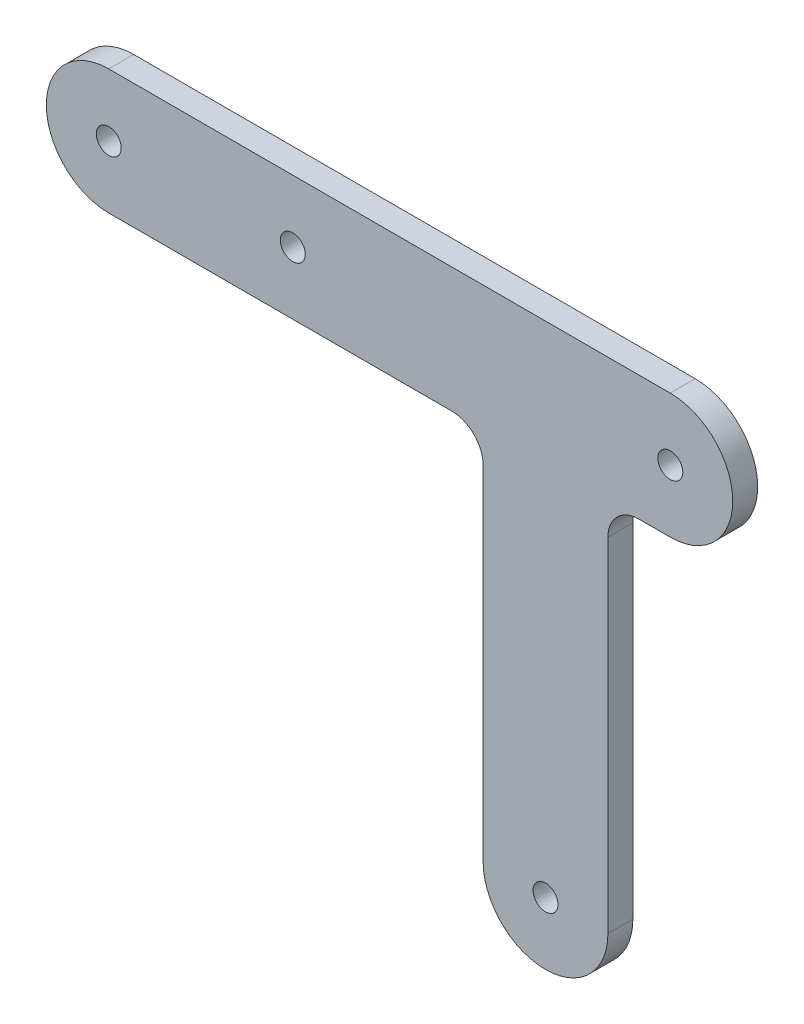
ISO-10303-21;
HEADER;
FILE_DESCRIPTION(('STEP AP214'),'2;1');
FILE_NAME('part.step','',(''),(''),'','','');
FILE_SCHEMA(('AUTOMOTIVE_DESIGN { 1 0 10303 214 1 1 1 1 }'));
ENDSEC;
DATA;
#1=APPLICATION_CONTEXT('core data for automotive mechanical design processes');
#2=APPLICATION_PROTOCOL_DEFINITION('international standard','automotive_design',2000,#1);
#3=PRODUCT_CONTEXT('',#1,'mechanical');
#4=PRODUCT('Part','Part','',(#3));
#5=PRODUCT_RELATED_PRODUCT_CATEGORY('part','',(#4));
#6=PRODUCT_DEFINITION_FORMATION('','',#4);
#7=PRODUCT_DEFINITION_CONTEXT('part definition',#1,'design');
#8=PRODUCT_DEFINITION('design','',#6,#7);
#9=PRODUCT_DEFINITION_SHAPE('','',#8);
#10=(LENGTH_UNIT() NAMED_UNIT(*) SI_UNIT(.MILLI.,.METRE.));
#11=(NAMED_UNIT(*) PLANE_ANGLE_UNIT() SI_UNIT($,.RADIAN.));
#12=(NAMED_UNIT(*) SI_UNIT($,.STERADIAN.) SOLID_ANGLE_UNIT());
#13=UNCERTAINTY_MEASURE_WITH_UNIT(LENGTH_MEASURE(1.E-05),#10,'distance_accuracy_value','');
#14=(GEOMETRIC_REPRESENTATION_CONTEXT(3) GLOBAL_UNCERTAINTY_ASSIGNED_CONTEXT((#13)) GLOBAL_UNIT_ASSIGNED_CONTEXT((#10,
#11,#12)) REPRESENTATION_CONTEXT('',''));
#15=CARTESIAN_POINT('',(0.,0.,0.));
#16=DIRECTION('',(0.,0.,1.));
#17=DIRECTION('',(1.,0.,0.));
#18=AXIS2_PLACEMENT_3D('',#15,#16,#17);
#19=CARTESIAN_POINT('',(0.,-15.6780851241907,4.));
#20=DIRECTION('',(0.,-1.,0.));
#21=DIRECTION('',(0.,0.,-1.));
#22=AXIS2_PLACEMENT_3D('',#19,#20,#21);
#23=PLANE('',#22);
#24=DIRECTION('',(-1.,0.,0.));
#25=VECTOR('',#24,1.);
#26=CARTESIAN_POINT('',(0.,-15.6780851241907,0.));
#27=LINE('',#26,#25);
#28=CARTESIAN_POINT('',(-8.1082175024389,-15.6780851241907,0.));
#29=VERTEX_POINT('',#28);
#30=CARTESIAN_POINT('',(-13.1082175024389,-15.6780851241907,0.));
#31=VERTEX_POINT('',#30);
#32=EDGE_CURVE('E157',#29,#31,#27,.T.);
#33=ORIENTED_EDGE('',*,*,#32,.F.);
#34=DIRECTION('',(0.,0.,-1.));
#35=VECTOR('',#34,1.);
#36=CARTESIAN_POINT('',(-8.1082175024389,-15.6780851241907,4.));
#37=LINE('',#36,#35);
#38=CARTESIAN_POINT('',(-8.1082175024389,-15.6780851241907,4.));
#39=VERTEX_POINT('',#38);
#40=EDGE_CURVE('E11',#39,#29,#37,.T.);
#41=ORIENTED_EDGE('',*,*,#40,.F.);
#42=DIRECTION('',(-1.,0.,0.));
#43=VECTOR('',#42,1.);
#44=CARTESIAN_POINT('',(0.,-15.6780851241907,4.));
#45=LINE('',#44,#43);
#46=CARTESIAN_POINT('',(-13.1082175024389,-15.6780851241907,4.));
#47=VERTEX_POINT('',#46);
#48=EDGE_CURVE('E192',#39,#47,#45,.T.);
#49=ORIENTED_EDGE('',*,*,#48,.T.);
#50=DIRECTION('',(0.,0.,-1.));
#51=VECTOR('',#50,1.);
#52=CARTESIAN_POINT('',(-13.1082175024389,-15.6780851241907,4.));
#53=LINE('',#52,#51);
#54=EDGE_CURVE('E53',#47,#31,#53,.T.);
#55=ORIENTED_EDGE('',*,*,#54,.T.);
#56=EDGE_LOOP('',(#33,#41,#49,#55));
#57=FACE_BOUND('',#56,.T.);
#58=ADVANCED_FACE('F37',(#57),#23,.T.);
#59=CARTESIAN_POINT('',(-8.1082175024389,-5.67808512419069,4.));
#60=DIRECTION('',(0.,0.,-1.));
#61=DIRECTION('',(-1.,0.,0.));
#62=AXIS2_PLACEMENT_3D('',#59,#60,#61);
#63=CYLINDRICAL_SURFACE('',#62,10.);
#64=CARTESIAN_POINT('',(-8.1082175024389,-5.67808512419069,0.));
#65=DIRECTION('',(0.,0.,1.));
#66=DIRECTION('',(1.,0.,0.));
#67=AXIS2_PLACEMENT_3D('',#64,#65,#66);
#68=CIRCLE('',#67,10.);
#69=CARTESIAN_POINT('',(-8.1082175024389,4.32191487580931,0.));
#70=VERTEX_POINT('',#69);
#71=EDGE_CURVE('E159',#29,#70,#68,.T.);
#72=ORIENTED_EDGE('',*,*,#71,.T.);
#73=DIRECTION('',(0.,0.,-1.));
#74=VECTOR('',#73,1.);
#75=CARTESIAN_POINT('',(-8.1082175024389,4.32191487580931,4.));
#76=LINE('',#75,#74);
#77=CARTESIAN_POINT('',(-8.1082175024389,4.32191487580931,4.));
#78=VERTEX_POINT('',#77);
#79=EDGE_CURVE('E45',#78,#70,#76,.T.);
#80=ORIENTED_EDGE('',*,*,#79,.F.);
#81=CARTESIAN_POINT('',(-8.1082175024389,-5.67808512419069,4.));
#82=DIRECTION('',(0.,0.,1.));
#83=DIRECTION('',(1.,0.,0.));
#84=AXIS2_PLACEMENT_3D('',#81,#82,#83);
#85=CIRCLE('',#84,10.);
#86=EDGE_CURVE('E230',#39,#78,#85,.T.);
#87=ORIENTED_EDGE('',*,*,#86,.F.);
#88=ORIENTED_EDGE('',*,*,#40,.T.);
#89=EDGE_LOOP('',(#72,#80,#87,#88));
#90=FACE_BOUND('',#89,.T.);
#91=ADVANCED_FACE('F252',(#90),#63,.T.);
#92=CARTESIAN_POINT('',(0.,4.32191487580931,4.));
#93=DIRECTION('',(0.,-1.,0.));
#94=DIRECTION('',(1.,0.,0.));
#95=AXIS2_PLACEMENT_3D('',#92,#93,#94);
#96=PLANE('',#95);
#97=DIRECTION('',(-1.,0.,0.));
#98=VECTOR('',#97,1.);
#99=CARTESIAN_POINT('',(0.,4.32191487580931,0.));
#100=LINE('',#99,#98);
#101=CARTESIAN_POINT('',(-98.1082175024389,4.3219148758093,0.));
#102=VERTEX_POINT('',#101);
#103=EDGE_CURVE('E161',#70,#102,#100,.T.);
#104=ORIENTED_EDGE('',*,*,#103,.T.);
#105=DIRECTION('',(0.,0.,-1.));
#106=VECTOR('',#105,1.);
#107=CARTESIAN_POINT('',(-98.1082175024389,4.3219148758093,4.));
#108=LINE('',#107,#106);
#109=CARTESIAN_POINT('',(-98.1082175024389,4.3219148758093,4.));
#110=VERTEX_POINT('',#109);
#111=EDGE_CURVE('E202',#110,#102,#108,.T.);
#112=ORIENTED_EDGE('',*,*,#111,.F.);
#113=DIRECTION('',(-1.,0.,0.));
#114=VECTOR('',#113,1.);
#115=CARTESIAN_POINT('',(0.,4.32191487580931,4.));
#116=LINE('',#115,#114);
#117=EDGE_CURVE('E211',#78,#110,#116,.T.);
#118=ORIENTED_EDGE('',*,*,#117,.F.);
#119=ORIENTED_EDGE('',*,*,#79,.T.);
#120=EDGE_LOOP('',(#104,#112,#118,#119));
#121=FACE_BOUND('',#120,.T.);
#122=ADVANCED_FACE('F209',(#121),#96,.F.);
#123=CARTESIAN_POINT('',(-98.1082175024389,-5.67808512418913,4.));
#124=DIRECTION('',(0.,0.,-1.));
#125=DIRECTION('',(-1.,0.,0.));
#126=AXIS2_PLACEMENT_3D('',#123,#124,#125);
#127=CYLINDRICAL_SURFACE('',#126,10.);
#128=CARTESIAN_POINT('',(-98.1082175024389,-5.67808512418913,0.));
#129=DIRECTION('',(0.,0.,1.));
#130=DIRECTION('',(1.,0.,0.));
#131=AXIS2_PLACEMENT_3D('',#128,#129,#130);
#132=CIRCLE('',#131,10.);
#133=CARTESIAN_POINT('',(-98.1082175024389,-15.6780851241907,0.));
#134=VERTEX_POINT('',#133);
#135=EDGE_CURVE('E163',#102,#134,#132,.T.);
#136=ORIENTED_EDGE('',*,*,#135,.T.);
#137=DIRECTION('',(0.,0.,-1.));
#138=VECTOR('',#137,1.);
#139=CARTESIAN_POINT('',(-98.1082175024389,-15.6780851241907,4.));
#140=LINE('',#139,#138);
#141=CARTESIAN_POINT('',(-98.1082175024389,-15.6780851241907,4.));
#142=VERTEX_POINT('',#141);
#143=EDGE_CURVE('E200',#142,#134,#140,.T.);
#144=ORIENTED_EDGE('',*,*,#143,.F.);
#145=CARTESIAN_POINT('',(-98.1082175024389,-5.67808512418913,4.));
#146=DIRECTION('',(0.,0.,1.));
#147=DIRECTION('',(1.,0.,0.));
#148=AXIS2_PLACEMENT_3D('',#145,#146,#147);
#149=CIRCLE('',#148,10.);
#150=EDGE_CURVE('E224',#110,#142,#149,.T.);
#151=ORIENTED_EDGE('',*,*,#150,.F.);
#152=ORIENTED_EDGE('',*,*,#111,.T.);
#153=EDGE_LOOP('',(#136,#144,#151,#152));
#154=FACE_BOUND('',#153,.T.);
#155=ADVANCED_FACE('F221',(#154),#127,.T.);
#156=CARTESIAN_POINT('',(0.,-15.6780851241907,4.));
#157=DIRECTION('',(0.,-1.,0.));
#158=DIRECTION('',(1.,0.,0.));
#159=AXIS2_PLACEMENT_3D('',#156,#157,#158);
#160=PLANE('',#159);
#161=DIRECTION('',(-1.,0.,0.));
#162=VECTOR('',#161,1.);
#163=CARTESIAN_POINT('',(0.,-15.6780851241907,0.));
#164=LINE('',#163,#162);
#165=CARTESIAN_POINT('',(-43.1082175024389,-15.6780851241907,0.));
#166=VERTEX_POINT('',#165);
#167=EDGE_CURVE('E166',#166,#134,#164,.T.);
#168=ORIENTED_EDGE('',*,*,#167,.F.);
#169=DIRECTION('',(0.,0.,-1.));
#170=VECTOR('',#169,1.);
#171=CARTESIAN_POINT('',(-43.1082175024389,-15.6780851241907,4.));
#172=LINE('',#171,#170);
#173=CARTESIAN_POINT('',(-43.1082175024389,-15.6780851241907,4.));
#174=VERTEX_POINT('',#173);
#175=EDGE_CURVE('E198',#174,#166,#172,.T.);
#176=ORIENTED_EDGE('',*,*,#175,.F.);
#177=DIRECTION('',(-1.,0.,0.));
#178=VECTOR('',#177,1.);
#179=CARTESIAN_POINT('',(0.,-15.6780851241907,4.));
#180=LINE('',#179,#178);
#181=EDGE_CURVE('E226',#174,#142,#180,.T.);
#182=ORIENTED_EDGE('',*,*,#181,.T.);
#183=ORIENTED_EDGE('',*,*,#143,.T.);
#184=EDGE_LOOP('',(#168,#176,#182,#183));
#185=FACE_BOUND('',#184,.T.);
#186=ADVANCED_FACE('F239',(#185),#160,.T.);
#187=CARTESIAN_POINT('',(-43.1082175024389,-20.6780851241907,4.));
#188=DIRECTION('',(0.,0.,-1.));
#189=DIRECTION('',(-1.,0.,0.));
#190=AXIS2_PLACEMENT_3D('',#187,#188,#189);
#191=CYLINDRICAL_SURFACE('',#190,5.);
#192=CARTESIAN_POINT('',(-43.1082175024389,-20.6780851241907,0.));
#193=DIRECTION('',(0.,0.,1.));
#194=DIRECTION('',(1.,0.,0.));
#195=AXIS2_PLACEMENT_3D('',#192,#193,#194);
#196=CIRCLE('',#195,5.);
#197=CARTESIAN_POINT('',(-38.1082175024389,-20.6780851241907,0.));
#198=VERTEX_POINT('',#197);
#199=EDGE_CURVE('E169',#198,#166,#196,.T.);
#200=ORIENTED_EDGE('',*,*,#199,.F.);
#201=DIRECTION('',(0.,0.,-1.));
#202=VECTOR('',#201,1.);
#203=CARTESIAN_POINT('',(-38.1082175024389,-20.6780851241907,4.));
#204=LINE('',#203,#202);
#205=CARTESIAN_POINT('',(-38.1082175024389,-20.6780851241907,4.));
#206=VERTEX_POINT('',#205);
#207=EDGE_CURVE('E196',#206,#198,#204,.T.);
#208=ORIENTED_EDGE('',*,*,#207,.F.);
#209=CARTESIAN_POINT('',(-43.1082175024389,-20.6780851241907,4.));
#210=DIRECTION('',(0.,0.,1.));
#211=DIRECTION('',(1.,0.,0.));
#212=AXIS2_PLACEMENT_3D('',#209,#210,#211);
#213=CIRCLE('',#212,5.);
#214=EDGE_CURVE('E228',#206,#174,#213,.T.);
#215=ORIENTED_EDGE('',*,*,#214,.T.);
#216=ORIENTED_EDGE('',*,*,#175,.T.);
#217=EDGE_LOOP('',(#200,#208,#215,#216));
#218=FACE_BOUND('',#217,.T.);
#219=ADVANCED_FACE('F237',(#218),#191,.F.);
#220=CARTESIAN_POINT('',(-38.1082175024389,0.,4.));
#221=DIRECTION('',(1.,0.,0.));
#222=DIRECTION('',(0.,1.,0.));
#223=AXIS2_PLACEMENT_3D('',#220,#221,#222);
#224=PLANE('',#223);
#225=DIRECTION('',(0.,-1.,0.));
#226=VECTOR('',#225,1.);
#227=CARTESIAN_POINT('',(-38.1082175024389,0.,0.));
#228=LINE('',#227,#226);
#229=CARTESIAN_POINT('',(-38.1082175024389,-75.6780851241907,0.));
#230=VERTEX_POINT('',#229);
#231=EDGE_CURVE('E172',#198,#230,#228,.T.);
#232=ORIENTED_EDGE('',*,*,#231,.T.);
#233=DIRECTION('',(0.,0.,-1.));
#234=VECTOR('',#233,1.);
#235=CARTESIAN_POINT('',(-38.1082175024389,-75.6780851241907,4.));
#236=LINE('',#235,#234);
#237=CARTESIAN_POINT('',(-38.1082175024389,-75.6780851241907,4.));
#238=VERTEX_POINT('',#237);
#239=EDGE_CURVE('E137',#238,#230,#236,.T.);
#240=ORIENTED_EDGE('',*,*,#239,.F.);
#241=DIRECTION('',(0.,-1.,0.));
#242=VECTOR('',#241,1.);
#243=CARTESIAN_POINT('',(-38.1082175024389,0.,4.));
#244=LINE('',#243,#242);
#245=EDGE_CURVE('E125',#206,#238,#244,.T.);
#246=ORIENTED_EDGE('',*,*,#245,.F.);
#247=ORIENTED_EDGE('',*,*,#207,.T.);
#248=EDGE_LOOP('',(#232,#240,#246,#247));
#249=FACE_BOUND('',#248,.T.);
#250=ADVANCED_FACE('F242',(#249),#224,.F.);
#251=CARTESIAN_POINT('',(-28.1082175024389,-75.6780851241907,4.));
#252=DIRECTION('',(0.,0.,-1.));
#253=DIRECTION('',(-1.,0.,0.));
#254=AXIS2_PLACEMENT_3D('',#251,#252,#253);
#255=CYLINDRICAL_SURFACE('',#254,10.);
#256=CARTESIAN_POINT('',(-28.1082175024389,-75.6780851241907,0.));
#257=DIRECTION('',(0.,0.,1.));
#258=DIRECTION('',(1.,0.,0.));
#259=AXIS2_PLACEMENT_3D('',#256,#257,#258);
#260=CIRCLE('',#259,10.);
#261=CARTESIAN_POINT('',(-18.1082175024389,-75.6780851241907,0.));
#262=VERTEX_POINT('',#261);
#263=EDGE_CURVE('E134',#230,#262,#260,.T.);
#264=ORIENTED_EDGE('',*,*,#263,.T.);
#265=DIRECTION('',(0.,0.,-1.));
#266=VECTOR('',#265,1.);
#267=CARTESIAN_POINT('',(-18.1082175024389,-75.6780851241907,4.));
#268=LINE('',#267,#266);
#269=CARTESIAN_POINT('',(-18.1082175024389,-75.6780851241907,4.));
#270=VERTEX_POINT('',#269);
#271=EDGE_CURVE('E131',#270,#262,#268,.T.);
#272=ORIENTED_EDGE('',*,*,#271,.F.);
#273=CARTESIAN_POINT('',(-28.1082175024389,-75.6780851241907,4.));
#274=DIRECTION('',(0.,0.,1.));
#275=DIRECTION('',(1.,0.,0.));
#276=AXIS2_PLACEMENT_3D('',#273,#274,#275);
#277=CIRCLE('',#276,10.);
#278=EDGE_CURVE('E115',#238,#270,#277,.T.);
#279=ORIENTED_EDGE('',*,*,#278,.F.);
#280=ORIENTED_EDGE('',*,*,#239,.T.);
#281=EDGE_LOOP('',(#264,#272,#279,#280));
#282=FACE_BOUND('',#281,.T.);
#283=ADVANCED_FACE('F132',(#282),#255,.T.);
#284=CARTESIAN_POINT('',(-18.1082175024389,0.,4.));
#285=DIRECTION('',(1.,0.,0.));
#286=DIRECTION('',(0.,1.,0.));
#287=AXIS2_PLACEMENT_3D('',#284,#285,#286);
#288=PLANE('',#287);
#289=DIRECTION('',(0.,-1.,0.));
#290=VECTOR('',#289,1.);
#291=CARTESIAN_POINT('',(-18.1082175024389,0.,0.));
#292=LINE('',#291,#290);
#293=CARTESIAN_POINT('',(-18.1082175024389,-20.6780851241907,0.));
#294=VERTEX_POINT('',#293);
#295=EDGE_CURVE('E175',#294,#262,#292,.T.);
#296=ORIENTED_EDGE('',*,*,#295,.F.);
#297=DIRECTION('',(0.,0.,-1.));
#298=VECTOR('',#297,1.);
#299=CARTESIAN_POINT('',(-18.1082175024389,-20.6780851241907,4.));
#300=LINE('',#299,#298);
#301=CARTESIAN_POINT('',(-18.1082175024389,-20.6780851241907,4.));
#302=VERTEX_POINT('',#301);
#303=EDGE_CURVE('E84',#302,#294,#300,.T.);
#304=ORIENTED_EDGE('',*,*,#303,.F.);
#305=DIRECTION('',(0.,-1.,0.));
#306=VECTOR('',#305,1.);
#307=CARTESIAN_POINT('',(-18.1082175024389,0.,4.));
#308=LINE('',#307,#306);
#309=EDGE_CURVE('E122',#302,#270,#308,.T.);
#310=ORIENTED_EDGE('',*,*,#309,.T.);
#311=ORIENTED_EDGE('',*,*,#271,.T.);
#312=EDGE_LOOP('',(#296,#304,#310,#311));
#313=FACE_BOUND('',#312,.T.);
#314=ADVANCED_FACE('F139',(#313),#288,.T.);
#315=CARTESIAN_POINT('',(-8.1082175024389,-5.67808512419069,4.));
#316=DIRECTION('',(0.,0.,-1.));
#317=DIRECTION('',(-1.,0.,0.));
#318=AXIS2_PLACEMENT_3D('',#315,#316,#317);
#319=CYLINDRICAL_SURFACE('',#318,2.);
#320=CARTESIAN_POINT('',(-8.1082175024389,-5.67808512419069,4.));
#321=DIRECTION('',(0.,0.,1.));
#322=DIRECTION('',(1.,0.,0.));
#323=AXIS2_PLACEMENT_3D('',#320,#321,#322);
#324=CIRCLE('',#323,2.);
#325=CARTESIAN_POINT('',(-6.1082175024389,-5.67808512419069,4.));
#326=VERTEX_POINT('',#325);
#327=EDGE_CURVE('E151',#326,#326,#324,.T.);
#328=ORIENTED_EDGE('',*,*,#327,.T.);
#329=EDGE_LOOP('',(#328));
#330=FACE_BOUND('',#329,.T.);
#331=CARTESIAN_POINT('',(-8.1082175024389,-5.67808512419069,0.));
#332=DIRECTION('',(0.,0.,1.));
#333=DIRECTION('',(1.,0.,0.));
#334=AXIS2_PLACEMENT_3D('',#331,#332,#333);
#335=CIRCLE('',#334,2.);
#336=CARTESIAN_POINT('',(-6.1082175024389,-5.67808512419069,0.));
#337=VERTEX_POINT('',#336);
#338=EDGE_CURVE('E186',#337,#337,#335,.T.);
#339=ORIENTED_EDGE('',*,*,#338,.F.);
#340=EDGE_LOOP('',(#339));
#341=FACE_BOUND('',#340,.T.);
#342=ADVANCED_FACE('F273',(#330,#341),#319,.F.);
#343=CARTESIAN_POINT('',(-68.6082175024389,-5.67808512418922,4.));
#344=DIRECTION('',(0.,0.,-1.));
#345=DIRECTION('',(-1.,0.,0.));
#346=AXIS2_PLACEMENT_3D('',#343,#344,#345);
#347=CYLINDRICAL_SURFACE('',#346,2.);
#348=CARTESIAN_POINT('',(-68.6082175024389,-5.67808512418922,4.));
#349=DIRECTION('',(0.,0.,1.));
#350=DIRECTION('',(1.,0.,0.));
#351=AXIS2_PLACEMENT_3D('',#348,#349,#350);
#352=CIRCLE('',#351,2.);
#353=CARTESIAN_POINT('',(-66.6082175024389,-5.67808512418922,4.));
#354=VERTEX_POINT('',#353);
#355=EDGE_CURVE('E148',#354,#354,#352,.T.);
#356=ORIENTED_EDGE('',*,*,#355,.T.);
#357=EDGE_LOOP('',(#356));
#358=FACE_BOUND('',#357,.T.);
#359=CARTESIAN_POINT('',(-68.6082175024389,-5.67808512418922,0.));
#360=DIRECTION('',(0.,0.,1.));
#361=DIRECTION('',(1.,0.,0.));
#362=AXIS2_PLACEMENT_3D('',#359,#360,#361);
#363=CIRCLE('',#362,2.);
#364=CARTESIAN_POINT('',(-66.6082175024389,-5.67808512418922,0.));
#365=VERTEX_POINT('',#364);
#366=EDGE_CURVE('E183',#365,#365,#363,.T.);
#367=ORIENTED_EDGE('',*,*,#366,.F.);
#368=EDGE_LOOP('',(#367));
#369=FACE_BOUND('',#368,.T.);
#370=ADVANCED_FACE('F267',(#358,#369),#347,.F.);
#371=CARTESIAN_POINT('',(-28.1082175024389,-75.6780851241907,4.));
#372=DIRECTION('',(0.,0.,-1.));
#373=DIRECTION('',(-1.,0.,0.));
#374=AXIS2_PLACEMENT_3D('',#371,#372,#373);
#375=CYLINDRICAL_SURFACE('',#374,2.);
#376=CARTESIAN_POINT('',(-28.1082175024389,-75.6780851241907,4.));
#377=DIRECTION('',(0.,0.,1.));
#378=DIRECTION('',(1.,0.,0.));
#379=AXIS2_PLACEMENT_3D('',#376,#377,#378);
#380=CIRCLE('',#379,2.);
#381=CARTESIAN_POINT('',(-26.1082175024389,-75.6780851241907,4.));
#382=VERTEX_POINT('',#381);
#383=EDGE_CURVE('E142',#382,#382,#380,.T.);
#384=ORIENTED_EDGE('',*,*,#383,.T.);
#385=EDGE_LOOP('',(#384));
#386=FACE_BOUND('',#385,.T.);
#387=CARTESIAN_POINT('',(-28.1082175024389,-75.6780851241907,0.));
#388=DIRECTION('',(0.,0.,1.));
#389=DIRECTION('',(1.,0.,0.));
#390=AXIS2_PLACEMENT_3D('',#387,#388,#389);
#391=CIRCLE('',#390,2.);
#392=CARTESIAN_POINT('',(-26.1082175024389,-75.6780851241907,0.));
#393=VERTEX_POINT('',#392);
#394=EDGE_CURVE('E180',#393,#393,#391,.T.);
#395=ORIENTED_EDGE('',*,*,#394,.F.);
#396=EDGE_LOOP('',(#395));
#397=FACE_BOUND('',#396,.T.);
#398=ADVANCED_FACE('F259',(#386,#397),#375,.F.);
#399=CARTESIAN_POINT('',(-13.1082175024389,-20.6780851241907,4.));
#400=DIRECTION('',(0.,0.,-1.));
#401=DIRECTION('',(-1.,0.,0.));
#402=AXIS2_PLACEMENT_3D('',#399,#400,#401);
#403=CYLINDRICAL_SURFACE('',#402,5.);
#404=CARTESIAN_POINT('',(-13.1082175024389,-20.6780851241907,0.));
#405=DIRECTION('',(0.,0.,1.));
#406=DIRECTION('',(1.,0.,0.));
#407=AXIS2_PLACEMENT_3D('',#404,#405,#406);
#408=CIRCLE('',#407,5.);
#409=EDGE_CURVE('E177',#31,#294,#408,.T.);
#410=ORIENTED_EDGE('',*,*,#409,.F.);
#411=ORIENTED_EDGE('',*,*,#54,.F.);
#412=CARTESIAN_POINT('',(-13.1082175024389,-20.6780851241907,4.));
#413=DIRECTION('',(0.,0.,1.));
#414=DIRECTION('',(1.,0.,0.));
#415=AXIS2_PLACEMENT_3D('',#412,#413,#414);
#416=CIRCLE('',#415,5.);
#417=EDGE_CURVE('E140',#47,#302,#416,.T.);
#418=ORIENTED_EDGE('',*,*,#417,.T.);
#419=ORIENTED_EDGE('',*,*,#303,.T.);
#420=EDGE_LOOP('',(#410,#411,#418,#419));
#421=FACE_BOUND('',#420,.T.);
#422=ADVANCED_FACE('F256',(#421),#403,.F.);
#423=CARTESIAN_POINT('',(-98.1082175024389,-5.67808512418913,4.));
#424=DIRECTION('',(0.,0.,-1.));
#425=DIRECTION('',(-1.,0.,0.));
#426=AXIS2_PLACEMENT_3D('',#423,#424,#425);
#427=CYLINDRICAL_SURFACE('',#426,2.);
#428=CARTESIAN_POINT('',(-98.1082175024389,-5.67808512418913,4.));
#429=DIRECTION('',(0.,0.,1.));
#430=DIRECTION('',(1.,0.,0.));
#431=AXIS2_PLACEMENT_3D('',#428,#429,#430);
#432=CIRCLE('',#431,2.);
#433=CARTESIAN_POINT('',(-96.1082175024389,-5.67808512418913,4.));
#434=VERTEX_POINT('',#433);
#435=EDGE_CURVE('E154',#434,#434,#432,.T.);
#436=ORIENTED_EDGE('',*,*,#435,.T.);
#437=EDGE_LOOP('',(#436));
#438=FACE_BOUND('',#437,.T.);
#439=CARTESIAN_POINT('',(-98.1082175024389,-5.67808512418913,0.));
#440=DIRECTION('',(0.,0.,1.));
#441=DIRECTION('',(1.,0.,0.));
#442=AXIS2_PLACEMENT_3D('',#439,#440,#441);
#443=CIRCLE('',#442,2.);
#444=CARTESIAN_POINT('',(-96.1082175024389,-5.67808512418913,0.));
#445=VERTEX_POINT('',#444);
#446=EDGE_CURVE('E189',#445,#445,#443,.T.);
#447=ORIENTED_EDGE('',*,*,#446,.F.);
#448=EDGE_LOOP('',(#447));
#449=FACE_BOUND('',#448,.T.);
#450=ADVANCED_FACE('F258',(#438,#449),#427,.F.);
#451=CARTESIAN_POINT('',(0.,0.,4.));
#452=DIRECTION('',(0.,0.,1.));
#453=DIRECTION('',(1.,0.,0.));
#454=AXIS2_PLACEMENT_3D('',#451,#452,#453);
#455=PLANE('',#454);
#456=ORIENTED_EDGE('',*,*,#48,.F.);
#457=ORIENTED_EDGE('',*,*,#86,.T.);
#458=ORIENTED_EDGE('',*,*,#117,.T.);
#459=ORIENTED_EDGE('',*,*,#150,.T.);
#460=ORIENTED_EDGE('',*,*,#181,.F.);
#461=ORIENTED_EDGE('',*,*,#214,.F.);
#462=ORIENTED_EDGE('',*,*,#245,.T.);
#463=ORIENTED_EDGE('',*,*,#278,.T.);
#464=ORIENTED_EDGE('',*,*,#309,.F.);
#465=ORIENTED_EDGE('',*,*,#417,.F.);
#466=EDGE_LOOP('',(#456,#457,#458,#459,#460,#461,#462,#463,#464,#465));
#467=FACE_BOUND('',#466,.T.);
#468=ORIENTED_EDGE('',*,*,#383,.F.);
#469=EDGE_LOOP('',(#468));
#470=FACE_BOUND('',#469,.T.);
#471=ORIENTED_EDGE('',*,*,#355,.F.);
#472=EDGE_LOOP('',(#471));
#473=FACE_BOUND('',#472,.T.);
#474=ORIENTED_EDGE('',*,*,#327,.F.);
#475=EDGE_LOOP('',(#474));
#476=FACE_BOUND('',#475,.T.);
#477=ORIENTED_EDGE('',*,*,#435,.F.);
#478=EDGE_LOOP('',(#477));
#479=FACE_BOUND('',#478,.T.);
#480=ADVANCED_FACE('F118',(#467,#470,#473,#476,#479),#455,.T.);
#481=CARTESIAN_POINT('',(0.,0.,0.));
#482=DIRECTION('',(0.,0.,1.));
#483=DIRECTION('',(1.,0.,0.));
#484=AXIS2_PLACEMENT_3D('',#481,#482,#483);
#485=PLANE('',#484);
#486=ORIENTED_EDGE('',*,*,#32,.T.);
#487=ORIENTED_EDGE('',*,*,#409,.T.);
#488=ORIENTED_EDGE('',*,*,#295,.T.);
#489=ORIENTED_EDGE('',*,*,#263,.F.);
#490=ORIENTED_EDGE('',*,*,#231,.F.);
#491=ORIENTED_EDGE('',*,*,#199,.T.);
#492=ORIENTED_EDGE('',*,*,#167,.T.);
#493=ORIENTED_EDGE('',*,*,#135,.F.);
#494=ORIENTED_EDGE('',*,*,#103,.F.);
#495=ORIENTED_EDGE('',*,*,#71,.F.);
#496=EDGE_LOOP('',(#486,#487,#488,#489,#490,#491,#492,#493,#494,#495));
#497=FACE_BOUND('',#496,.T.);
#498=ORIENTED_EDGE('',*,*,#394,.T.);
#499=EDGE_LOOP('',(#498));
#500=FACE_BOUND('',#499,.T.);
#501=ORIENTED_EDGE('',*,*,#366,.T.);
#502=EDGE_LOOP('',(#501));
#503=FACE_BOUND('',#502,.T.);
#504=ORIENTED_EDGE('',*,*,#338,.T.);
#505=EDGE_LOOP('',(#504));
#506=FACE_BOUND('',#505,.T.);
#507=ORIENTED_EDGE('',*,*,#446,.T.);
#508=EDGE_LOOP('',(#507));
#509=FACE_BOUND('',#508,.T.);
#510=ADVANCED_FACE('F216',(#497,#500,#503,#506,#509),#485,.F.);
#511=CLOSED_SHELL('',(#58,#91,#122,#155,#186,#219,#250,#283,#314,#342,#370,#398,#422,#450,#480,#510));
#512=MANIFOLD_SOLID_BREP('B2',#511);
#513=ADVANCED_BREP_SHAPE_REPRESENTATION('',(#18,#512),#14);
#514=SHAPE_DEFINITION_REPRESENTATION(#9,#513);
ENDSEC;
END-ISO-10303-21;
